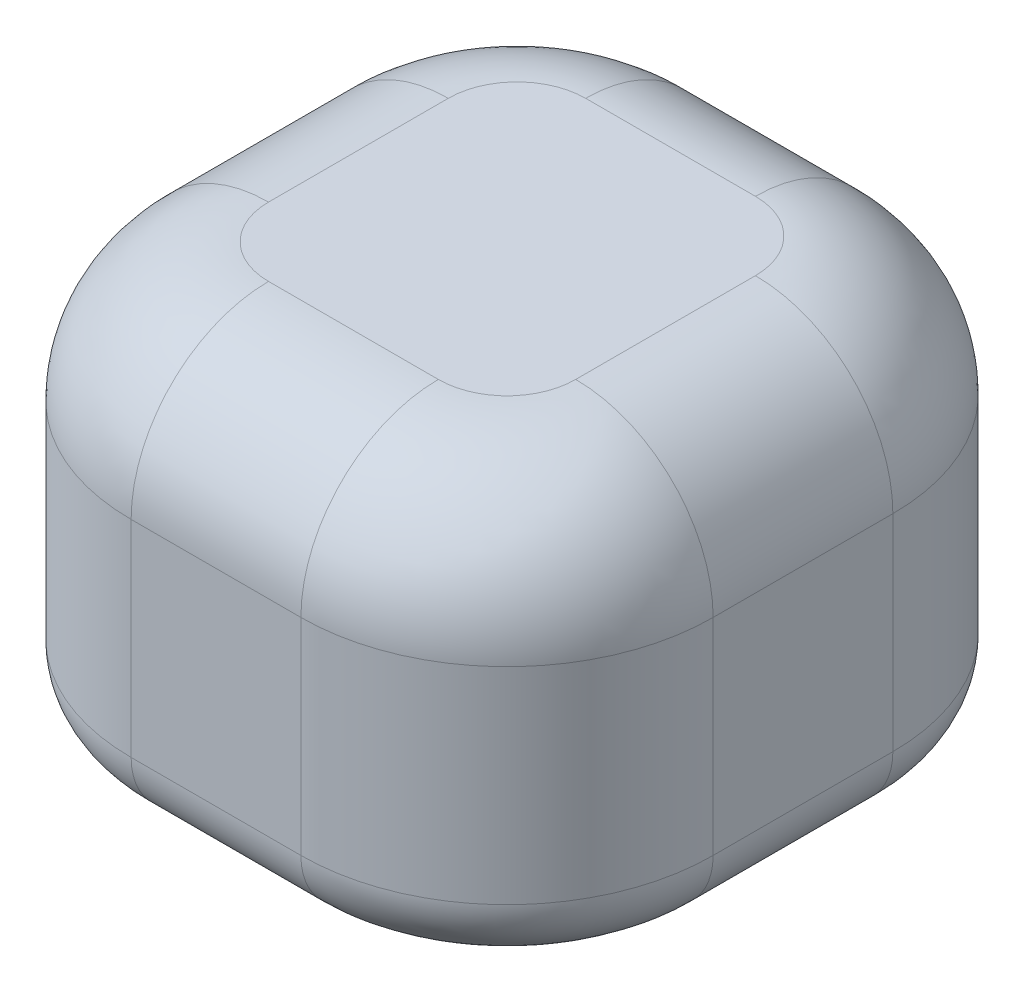
ISO-10303-21;
HEADER;
FILE_DESCRIPTION(('STEP AP214'),'2;1');
FILE_NAME('part.step','',(''),(''),'','','');
FILE_SCHEMA(('AUTOMOTIVE_DESIGN { 1 0 10303 214 1 1 1 1 }'));
ENDSEC;
DATA;
#1=APPLICATION_CONTEXT('core data for automotive mechanical design processes');
#2=APPLICATION_PROTOCOL_DEFINITION('international standard','automotive_design',2000,#1);
#3=PRODUCT_CONTEXT('',#1,'mechanical');
#4=PRODUCT('Part','Part','',(#3));
#5=PRODUCT_RELATED_PRODUCT_CATEGORY('part','',(#4));
#6=PRODUCT_DEFINITION_FORMATION('','',#4);
#7=PRODUCT_DEFINITION_CONTEXT('part definition',#1,'design');
#8=PRODUCT_DEFINITION('design','',#6,#7);
#9=PRODUCT_DEFINITION_SHAPE('','',#8);
#10=(LENGTH_UNIT() NAMED_UNIT(*) SI_UNIT(.MILLI.,.METRE.));
#11=(NAMED_UNIT(*) PLANE_ANGLE_UNIT() SI_UNIT($,.RADIAN.));
#12=(NAMED_UNIT(*) SI_UNIT($,.STERADIAN.) SOLID_ANGLE_UNIT());
#13=UNCERTAINTY_MEASURE_WITH_UNIT(LENGTH_MEASURE(1.E-05),#10,'distance_accuracy_value','');
#14=(GEOMETRIC_REPRESENTATION_CONTEXT(3) GLOBAL_UNCERTAINTY_ASSIGNED_CONTEXT((#13)) GLOBAL_UNIT_ASSIGNED_CONTEXT((#10,
#11,#12)) REPRESENTATION_CONTEXT('',''));
#15=CARTESIAN_POINT('',(0.,0.,0.));
#16=DIRECTION('',(0.,0.,1.));
#17=DIRECTION('',(1.,0.,0.));
#18=AXIS2_PLACEMENT_3D('',#15,#16,#17);
#19=CARTESIAN_POINT('',(42.3541820083916,-30.,43.0798902011261));
#20=DIRECTION('',(1.,0.,0.));
#21=DIRECTION('',(0.,0.,-1.));
#22=AXIS2_PLACEMENT_3D('',#19,#20,#21);
#23=PLANE('',#22);
#24=DIRECTION('',(0.,1.,0.));
#25=VECTOR('',#24,1.);
#26=CARTESIAN_POINT('',(42.3541820083916,-30.,13.0798902011261));
#27=LINE('',#26,#25);
#28=CARTESIAN_POINT('',(42.3541820083916,10.,13.0798902011261));
#29=VERTEX_POINT('',#28);
#30=CARTESIAN_POINT('',(42.3541820083916,-20.,13.0798902011261));
#31=VERTEX_POINT('',#30);
#32=EDGE_CURVE('E292',#29,#31,#27,.F.);
#33=ORIENTED_EDGE('',*,*,#32,.T.);
#34=DIRECTION('',(0.,0.,-1.));
#35=VECTOR('',#34,1.);
#36=CARTESIAN_POINT('',(42.3541820083916,-20.,43.0798902011261));
#37=LINE('',#36,#35);
#38=CARTESIAN_POINT('',(42.3541820083916,-20.,-13.0798902011261));
#39=VERTEX_POINT('',#38);
#40=EDGE_CURVE('E11',#31,#39,#37,.T.);
#41=ORIENTED_EDGE('',*,*,#40,.T.);
#42=DIRECTION('',(0.,1.,0.));
#43=VECTOR('',#42,1.);
#44=CARTESIAN_POINT('',(42.3541820083916,-30.,-13.0798902011261));
#45=LINE('',#44,#43);
#46=CARTESIAN_POINT('',(42.3541820083916,10.,-13.0798902011261));
#47=VERTEX_POINT('',#46);
#48=EDGE_CURVE('E288',#39,#47,#45,.T.);
#49=ORIENTED_EDGE('',*,*,#48,.T.);
#50=DIRECTION('',(0.,0.,-1.));
#51=VECTOR('',#50,1.);
#52=CARTESIAN_POINT('',(42.3541820083916,10.,13.0798902011261));
#53=LINE('',#52,#51);
#54=EDGE_CURVE('E196',#47,#29,#53,.F.);
#55=ORIENTED_EDGE('',*,*,#54,.T.);
#56=EDGE_LOOP('',(#33,#41,#49,#55));
#57=FACE_BOUND('',#56,.T.);
#58=ADVANCED_FACE('F38',(#57),#23,.T.);
#59=CARTESIAN_POINT('',(-42.3541820083916,-30.,43.0798902011261));
#60=DIRECTION('',(0.,0.,1.));
#61=DIRECTION('',(1.,0.,0.));
#62=AXIS2_PLACEMENT_3D('',#59,#60,#61);
#63=PLANE('',#62);
#64=DIRECTION('',(0.,1.,0.));
#65=VECTOR('',#64,1.);
#66=CARTESIAN_POINT('',(-12.3541820083916,-30.,43.0798902011261));
#67=LINE('',#66,#65);
#68=CARTESIAN_POINT('',(-12.3541820083916,10.,43.0798902011261));
#69=VERTEX_POINT('',#68);
#70=CARTESIAN_POINT('',(-12.3541820083916,-20.,43.0798902011261));
#71=VERTEX_POINT('',#70);
#72=EDGE_CURVE('E221',#69,#71,#67,.F.);
#73=ORIENTED_EDGE('',*,*,#72,.T.);
#74=DIRECTION('',(1.,0.,0.));
#75=VECTOR('',#74,1.);
#76=CARTESIAN_POINT('',(-42.3541820083916,-20.,43.0798902011261));
#77=LINE('',#76,#75);
#78=CARTESIAN_POINT('',(12.3541820083916,-20.,43.0798902011261));
#79=VERTEX_POINT('',#78);
#80=EDGE_CURVE('E62',#71,#79,#77,.T.);
#81=ORIENTED_EDGE('',*,*,#80,.T.);
#82=DIRECTION('',(0.,1.,0.));
#83=VECTOR('',#82,1.);
#84=CARTESIAN_POINT('',(12.3541820083916,-30.,43.0798902011261));
#85=LINE('',#84,#83);
#86=CARTESIAN_POINT('',(12.3541820083916,10.,43.0798902011261));
#87=VERTEX_POINT('',#86);
#88=EDGE_CURVE('E286',#79,#87,#85,.T.);
#89=ORIENTED_EDGE('',*,*,#88,.T.);
#90=DIRECTION('',(1.,0.,0.));
#91=VECTOR('',#90,1.);
#92=CARTESIAN_POINT('',(-12.3541820083916,10.,43.0798902011261));
#93=LINE('',#92,#91);
#94=EDGE_CURVE('E201',#87,#69,#93,.F.);
#95=ORIENTED_EDGE('',*,*,#94,.T.);
#96=EDGE_LOOP('',(#73,#81,#89,#95));
#97=FACE_BOUND('',#96,.T.);
#98=ADVANCED_FACE('F285',(#97),#63,.T.);
#99=CARTESIAN_POINT('',(-42.3541820083916,-30.,43.0798902011261));
#100=DIRECTION('',(-1.,0.,0.));
#101=DIRECTION('',(0.,0.,1.));
#102=AXIS2_PLACEMENT_3D('',#99,#100,#101);
#103=PLANE('',#102);
#104=DIRECTION('',(0.,1.,0.));
#105=VECTOR('',#104,1.);
#106=CARTESIAN_POINT('',(-42.3541820083916,-30.,-13.0798902011261));
#107=LINE('',#106,#105);
#108=CARTESIAN_POINT('',(-42.3541820083916,10.,-13.0798902011261));
#109=VERTEX_POINT('',#108);
#110=CARTESIAN_POINT('',(-42.3541820083916,-20.,-13.0798902011261));
#111=VERTEX_POINT('',#110);
#112=EDGE_CURVE('E299',#109,#111,#107,.F.);
#113=ORIENTED_EDGE('',*,*,#112,.T.);
#114=DIRECTION('',(0.,0.,1.));
#115=VECTOR('',#114,1.);
#116=CARTESIAN_POINT('',(-42.3541820083916,-20.,43.0798902011261));
#117=LINE('',#116,#115);
#118=CARTESIAN_POINT('',(-42.3541820083916,-20.,13.0798902011261));
#119=VERTEX_POINT('',#118);
#120=EDGE_CURVE('E245',#111,#119,#117,.T.);
#121=ORIENTED_EDGE('',*,*,#120,.T.);
#122=DIRECTION('',(0.,1.,0.));
#123=VECTOR('',#122,1.);
#124=CARTESIAN_POINT('',(-42.3541820083916,-30.,13.0798902011261));
#125=LINE('',#124,#123);
#126=CARTESIAN_POINT('',(-42.3541820083916,10.,13.0798902011261));
#127=VERTEX_POINT('',#126);
#128=EDGE_CURVE('E174',#119,#127,#125,.T.);
#129=ORIENTED_EDGE('',*,*,#128,.T.);
#130=DIRECTION('',(0.,0.,1.));
#131=VECTOR('',#130,1.);
#132=CARTESIAN_POINT('',(-42.3541820083916,10.,-13.0798902011261));
#133=LINE('',#132,#131);
#134=EDGE_CURVE('E181',#127,#109,#133,.F.);
#135=ORIENTED_EDGE('',*,*,#134,.T.);
#136=EDGE_LOOP('',(#113,#121,#129,#135));
#137=FACE_BOUND('',#136,.T.);
#138=ADVANCED_FACE('F321',(#137),#103,.T.);
#139=CARTESIAN_POINT('',(-42.3541820083916,-30.,-43.0798902011261));
#140=DIRECTION('',(0.,0.,-1.));
#141=DIRECTION('',(-1.,0.,0.));
#142=AXIS2_PLACEMENT_3D('',#139,#140,#141);
#143=PLANE('',#142);
#144=DIRECTION('',(0.,1.,0.));
#145=VECTOR('',#144,1.);
#146=CARTESIAN_POINT('',(12.3541820083916,-30.,-43.0798902011261));
#147=LINE('',#146,#145);
#148=CARTESIAN_POINT('',(12.3541820083916,10.,-43.0798902011261));
#149=VERTEX_POINT('',#148);
#150=CARTESIAN_POINT('',(12.3541820083916,-20.,-43.0798902011261));
#151=VERTEX_POINT('',#150);
#152=EDGE_CURVE('E296',#149,#151,#147,.F.);
#153=ORIENTED_EDGE('',*,*,#152,.T.);
#154=DIRECTION('',(-1.,0.,0.));
#155=VECTOR('',#154,1.);
#156=CARTESIAN_POINT('',(-42.3541820083916,-20.,-43.0798902011261));
#157=LINE('',#156,#155);
#158=CARTESIAN_POINT('',(-12.3541820083916,-20.,-43.0798902011261));
#159=VERTEX_POINT('',#158);
#160=EDGE_CURVE('E241',#151,#159,#157,.T.);
#161=ORIENTED_EDGE('',*,*,#160,.T.);
#162=DIRECTION('',(0.,1.,0.));
#163=VECTOR('',#162,1.);
#164=CARTESIAN_POINT('',(-12.3541820083916,-30.,-43.0798902011261));
#165=LINE('',#164,#163);
#166=CARTESIAN_POINT('',(-12.3541820083916,10.,-43.0798902011261));
#167=VERTEX_POINT('',#166);
#168=EDGE_CURVE('E294',#159,#167,#165,.T.);
#169=ORIENTED_EDGE('',*,*,#168,.T.);
#170=DIRECTION('',(-1.,0.,0.));
#171=VECTOR('',#170,1.);
#172=CARTESIAN_POINT('',(12.3541820083916,10.,-43.0798902011261));
#173=LINE('',#172,#171);
#174=EDGE_CURVE('E191',#167,#149,#173,.F.);
#175=ORIENTED_EDGE('',*,*,#174,.T.);
#176=EDGE_LOOP('',(#153,#161,#169,#175));
#177=FACE_BOUND('',#176,.T.);
#178=ADVANCED_FACE('F375',(#177),#143,.T.);
#179=CARTESIAN_POINT('',(0.,-30.,0.));
#180=DIRECTION('',(0.,-1.,0.));
#181=DIRECTION('',(0.,0.,-1.));
#182=AXIS2_PLACEMENT_3D('',#179,#180,#181);
#183=PLANE('',#182);
#184=DIRECTION('',(-1.,0.,0.));
#185=VECTOR('',#184,1.);
#186=CARTESIAN_POINT('',(0.,-30.,-33.0798902011261));
#187=LINE('',#186,#185);
#188=CARTESIAN_POINT('',(-12.3541820083916,-30.,-33.0798902011261));
#189=VERTEX_POINT('',#188);
#190=CARTESIAN_POINT('',(12.3541820083916,-30.,-33.0798902011261));
#191=VERTEX_POINT('',#190);
#192=EDGE_CURVE('E233',#189,#191,#187,.F.);
#193=ORIENTED_EDGE('',*,*,#192,.T.);
#194=CARTESIAN_POINT('',(12.3541820083916,-30.,-13.0798902011261));
#195=DIRECTION('',(0.,-1.,0.));
#196=DIRECTION('',(0.,0.,-1.));
#197=AXIS2_PLACEMENT_3D('',#194,#195,#196);
#198=CIRCLE('',#197,20.);
#199=CARTESIAN_POINT('',(32.3541820083916,-30.,-13.0798902011261));
#200=VERTEX_POINT('',#199);
#201=EDGE_CURVE('E235',#191,#200,#198,.T.);
#202=ORIENTED_EDGE('',*,*,#201,.T.);
#203=DIRECTION('',(0.,0.,-1.));
#204=VECTOR('',#203,1.);
#205=CARTESIAN_POINT('',(32.3541820083916,-30.,0.));
#206=LINE('',#205,#204);
#207=CARTESIAN_POINT('',(32.3541820083916,-30.,13.0798902011261));
#208=VERTEX_POINT('',#207);
#209=EDGE_CURVE('E202',#200,#208,#206,.F.);
#210=ORIENTED_EDGE('',*,*,#209,.T.);
#211=CARTESIAN_POINT('',(12.3541820083916,-30.,13.0798902011261));
#212=DIRECTION('',(0.,-1.,0.));
#213=DIRECTION('',(0.,0.,-1.));
#214=AXIS2_PLACEMENT_3D('',#211,#212,#213);
#215=CIRCLE('',#214,20.);
#216=CARTESIAN_POINT('',(12.3541820083916,-30.,33.0798902011261));
#217=VERTEX_POINT('',#216);
#218=EDGE_CURVE('E223',#208,#217,#215,.T.);
#219=ORIENTED_EDGE('',*,*,#218,.T.);
#220=DIRECTION('',(1.,0.,0.));
#221=VECTOR('',#220,1.);
#222=CARTESIAN_POINT('',(0.,-30.,33.0798902011261));
#223=LINE('',#222,#221);
#224=CARTESIAN_POINT('',(-12.3541820083916,-30.,33.0798902011261));
#225=VERTEX_POINT('',#224);
#226=EDGE_CURVE('E225',#217,#225,#223,.F.);
#227=ORIENTED_EDGE('',*,*,#226,.T.);
#228=CARTESIAN_POINT('',(-12.3541820083916,-30.,13.0798902011261));
#229=DIRECTION('',(0.,-1.,0.));
#230=DIRECTION('',(0.,0.,-1.));
#231=AXIS2_PLACEMENT_3D('',#228,#229,#230);
#232=CIRCLE('',#231,20.);
#233=CARTESIAN_POINT('',(-32.3541820083916,-30.,13.0798902011261));
#234=VERTEX_POINT('',#233);
#235=EDGE_CURVE('E227',#225,#234,#232,.T.);
#236=ORIENTED_EDGE('',*,*,#235,.T.);
#237=DIRECTION('',(0.,0.,1.));
#238=VECTOR('',#237,1.);
#239=CARTESIAN_POINT('',(-32.3541820083916,-30.,0.));
#240=LINE('',#239,#238);
#241=CARTESIAN_POINT('',(-32.3541820083916,-30.,-13.0798902011261));
#242=VERTEX_POINT('',#241);
#243=EDGE_CURVE('E229',#234,#242,#240,.F.);
#244=ORIENTED_EDGE('',*,*,#243,.T.);
#245=CARTESIAN_POINT('',(-12.3541820083916,-30.,-13.0798902011261));
#246=DIRECTION('',(0.,-1.,0.));
#247=DIRECTION('',(0.,0.,-1.));
#248=AXIS2_PLACEMENT_3D('',#245,#246,#247);
#249=CIRCLE('',#248,20.);
#250=EDGE_CURVE('E231',#242,#189,#249,.T.);
#251=ORIENTED_EDGE('',*,*,#250,.T.);
#252=EDGE_LOOP('',(#193,#202,#210,#219,#227,#236,#244,#251));
#253=FACE_BOUND('',#252,.T.);
#254=ADVANCED_FACE('F338',(#253),#183,.T.);
#255=CARTESIAN_POINT('',(0.,30.,0.));
#256=DIRECTION('',(0.,-1.,0.));
#257=DIRECTION('',(0.,0.,-1.));
#258=AXIS2_PLACEMENT_3D('',#255,#256,#257);
#259=PLANE('',#258);
#260=DIRECTION('',(0.,0.,1.));
#261=VECTOR('',#260,1.);
#262=CARTESIAN_POINT('',(-22.3541820083916,30.,13.0798902011261));
#263=LINE('',#262,#261);
#264=CARTESIAN_POINT('',(-22.3541820083916,30.,-13.0798902011261));
#265=VERTEX_POINT('',#264);
#266=CARTESIAN_POINT('',(-22.3541820083916,30.,13.0798902011261));
#267=VERTEX_POINT('',#266);
#268=EDGE_CURVE('E178',#265,#267,#263,.T.);
#269=ORIENTED_EDGE('',*,*,#268,.T.);
#270=CARTESIAN_POINT('',(-12.3541820083916,30.,13.0798902011261));
#271=DIRECTION('',(0.,-1.,0.));
#272=DIRECTION('',(0.,0.,-1.));
#273=AXIS2_PLACEMENT_3D('',#270,#271,#272);
#274=CIRCLE('',#273,10.);
#275=CARTESIAN_POINT('',(-12.3541820083916,30.,23.0798902011261));
#276=VERTEX_POINT('',#275);
#277=EDGE_CURVE('E159',#267,#276,#274,.F.);
#278=ORIENTED_EDGE('',*,*,#277,.T.);
#279=DIRECTION('',(1.,0.,0.));
#280=VECTOR('',#279,1.);
#281=CARTESIAN_POINT('',(12.3541820083916,30.,23.0798902011261));
#282=LINE('',#281,#280);
#283=CARTESIAN_POINT('',(12.3541820083916,30.,23.0798902011261));
#284=VERTEX_POINT('',#283);
#285=EDGE_CURVE('E167',#276,#284,#282,.T.);
#286=ORIENTED_EDGE('',*,*,#285,.T.);
#287=CARTESIAN_POINT('',(12.3541820083916,30.,13.0798902011261));
#288=DIRECTION('',(0.,-1.,0.));
#289=DIRECTION('',(0.,0.,-1.));
#290=AXIS2_PLACEMENT_3D('',#287,#288,#289);
#291=CIRCLE('',#290,10.);
#292=CARTESIAN_POINT('',(22.3541820083916,30.,13.0798902011261));
#293=VERTEX_POINT('',#292);
#294=EDGE_CURVE('E173',#284,#293,#291,.F.);
#295=ORIENTED_EDGE('',*,*,#294,.T.);
#296=DIRECTION('',(0.,0.,-1.));
#297=VECTOR('',#296,1.);
#298=CARTESIAN_POINT('',(22.3541820083916,30.,-13.0798902011261));
#299=LINE('',#298,#297);
#300=CARTESIAN_POINT('',(22.3541820083916,30.,-13.0798902011261));
#301=VERTEX_POINT('',#300);
#302=EDGE_CURVE('E304',#293,#301,#299,.T.);
#303=ORIENTED_EDGE('',*,*,#302,.T.);
#304=CARTESIAN_POINT('',(12.3541820083916,30.,-13.0798902011261));
#305=DIRECTION('',(0.,-1.,0.));
#306=DIRECTION('',(0.,0.,-1.));
#307=AXIS2_PLACEMENT_3D('',#304,#305,#306);
#308=CIRCLE('',#307,10.);
#309=CARTESIAN_POINT('',(12.3541820083916,30.,-23.0798902011261));
#310=VERTEX_POINT('',#309);
#311=EDGE_CURVE('E306',#301,#310,#308,.F.);
#312=ORIENTED_EDGE('',*,*,#311,.T.);
#313=DIRECTION('',(-1.,0.,0.));
#314=VECTOR('',#313,1.);
#315=CARTESIAN_POINT('',(-12.3541820083916,30.,-23.0798902011261));
#316=LINE('',#315,#314);
#317=CARTESIAN_POINT('',(-12.3541820083916,30.,-23.0798902011261));
#318=VERTEX_POINT('',#317);
#319=EDGE_CURVE('E308',#310,#318,#316,.T.);
#320=ORIENTED_EDGE('',*,*,#319,.T.);
#321=CARTESIAN_POINT('',(-12.3541820083916,30.,-13.0798902011261));
#322=DIRECTION('',(0.,-1.,0.));
#323=DIRECTION('',(0.,0.,-1.));
#324=AXIS2_PLACEMENT_3D('',#321,#322,#323);
#325=CIRCLE('',#324,10.);
#326=EDGE_CURVE('E183',#318,#265,#325,.F.);
#327=ORIENTED_EDGE('',*,*,#326,.T.);
#328=EDGE_LOOP('',(#269,#278,#286,#295,#303,#312,#320,#327));
#329=FACE_BOUND('',#328,.T.);
#330=ADVANCED_FACE('F176',(#329),#259,.F.);
#331=CARTESIAN_POINT('',(12.3541820083916,-30.,13.0798902011261));
#332=DIRECTION('',(0.,1.,0.));
#333=DIRECTION('',(0.,0.,1.));
#334=AXIS2_PLACEMENT_3D('',#331,#332,#333);
#335=CYLINDRICAL_SURFACE('',#334,30.);
#336=ORIENTED_EDGE('',*,*,#88,.F.);
#337=CARTESIAN_POINT('',(12.3541820083916,-20.,13.0798902011261));
#338=DIRECTION('',(0.,-1.,0.));
#339=DIRECTION('',(0.,0.,-1.));
#340=AXIS2_PLACEMENT_3D('',#337,#338,#339);
#341=CIRCLE('',#340,30.);
#342=EDGE_CURVE('E47',#79,#31,#341,.F.);
#343=ORIENTED_EDGE('',*,*,#342,.T.);
#344=ORIENTED_EDGE('',*,*,#32,.F.);
#345=CARTESIAN_POINT('',(12.3541820083916,10.,13.0798902011261));
#346=DIRECTION('',(0.,-1.,0.));
#347=DIRECTION('',(0.,0.,-1.));
#348=AXIS2_PLACEMENT_3D('',#345,#346,#347);
#349=CIRCLE('',#348,30.);
#350=EDGE_CURVE('E198',#29,#87,#349,.T.);
#351=ORIENTED_EDGE('',*,*,#350,.T.);
#352=EDGE_LOOP('',(#336,#343,#344,#351));
#353=FACE_BOUND('',#352,.T.);
#354=ADVANCED_FACE('F377',(#353),#335,.T.);
#355=CARTESIAN_POINT('',(12.3541820083916,-30.,-13.0798902011261));
#356=DIRECTION('',(0.,1.,0.));
#357=DIRECTION('',(0.,0.,1.));
#358=AXIS2_PLACEMENT_3D('',#355,#356,#357);
#359=CYLINDRICAL_SURFACE('',#358,30.);
#360=ORIENTED_EDGE('',*,*,#48,.F.);
#361=CARTESIAN_POINT('',(12.3541820083916,-20.,-13.0798902011261));
#362=DIRECTION('',(0.,-1.,0.));
#363=DIRECTION('',(0.,0.,-1.));
#364=AXIS2_PLACEMENT_3D('',#361,#362,#363);
#365=CIRCLE('',#364,30.);
#366=EDGE_CURVE('E238',#39,#151,#365,.F.);
#367=ORIENTED_EDGE('',*,*,#366,.T.);
#368=ORIENTED_EDGE('',*,*,#152,.F.);
#369=CARTESIAN_POINT('',(12.3541820083916,10.,-13.0798902011261));
#370=DIRECTION('',(0.,-1.,0.));
#371=DIRECTION('',(0.,0.,-1.));
#372=AXIS2_PLACEMENT_3D('',#369,#370,#371);
#373=CIRCLE('',#372,30.);
#374=EDGE_CURVE('E193',#149,#47,#373,.T.);
#375=ORIENTED_EDGE('',*,*,#374,.T.);
#376=EDGE_LOOP('',(#360,#367,#368,#375));
#377=FACE_BOUND('',#376,.T.);
#378=ADVANCED_FACE('F354',(#377),#359,.T.);
#379=CARTESIAN_POINT('',(-12.3541820083916,-30.,13.0798902011261));
#380=DIRECTION('',(0.,1.,0.));
#381=DIRECTION('',(0.,0.,1.));
#382=AXIS2_PLACEMENT_3D('',#379,#380,#381);
#383=CYLINDRICAL_SURFACE('',#382,30.);
#384=ORIENTED_EDGE('',*,*,#128,.F.);
#385=CARTESIAN_POINT('',(-12.3541820083916,-20.,13.0798902011261));
#386=DIRECTION('',(0.,-1.,0.));
#387=DIRECTION('',(0.,0.,-1.));
#388=AXIS2_PLACEMENT_3D('',#385,#386,#387);
#389=CIRCLE('',#388,30.);
#390=EDGE_CURVE('E247',#119,#71,#389,.F.);
#391=ORIENTED_EDGE('',*,*,#390,.T.);
#392=ORIENTED_EDGE('',*,*,#72,.F.);
#393=CARTESIAN_POINT('',(-12.3541820083916,10.,13.0798902011261));
#394=DIRECTION('',(0.,-1.,0.));
#395=DIRECTION('',(0.,0.,-1.));
#396=AXIS2_PLACEMENT_3D('',#393,#394,#395);
#397=CIRCLE('',#396,30.);
#398=EDGE_CURVE('E161',#69,#127,#397,.T.);
#399=ORIENTED_EDGE('',*,*,#398,.T.);
#400=EDGE_LOOP('',(#384,#391,#392,#399));
#401=FACE_BOUND('',#400,.T.);
#402=ADVANCED_FACE('F284',(#401),#383,.T.);
#403=CARTESIAN_POINT('',(-12.3541820083916,-30.,-13.0798902011261));
#404=DIRECTION('',(0.,1.,0.));
#405=DIRECTION('',(0.,0.,1.));
#406=AXIS2_PLACEMENT_3D('',#403,#404,#405);
#407=CYLINDRICAL_SURFACE('',#406,30.);
#408=ORIENTED_EDGE('',*,*,#168,.F.);
#409=CARTESIAN_POINT('',(-12.3541820083916,-20.,-13.0798902011261));
#410=DIRECTION('',(0.,-1.,0.));
#411=DIRECTION('',(0.,0.,-1.));
#412=AXIS2_PLACEMENT_3D('',#409,#410,#411);
#413=CIRCLE('',#412,30.);
#414=EDGE_CURVE('E243',#159,#111,#413,.F.);
#415=ORIENTED_EDGE('',*,*,#414,.T.);
#416=ORIENTED_EDGE('',*,*,#112,.F.);
#417=CARTESIAN_POINT('',(-12.3541820083916,10.,-13.0798902011261));
#418=DIRECTION('',(0.,-1.,0.));
#419=DIRECTION('',(0.,0.,-1.));
#420=AXIS2_PLACEMENT_3D('',#417,#418,#419);
#421=CIRCLE('',#420,30.);
#422=EDGE_CURVE('E188',#109,#167,#421,.T.);
#423=ORIENTED_EDGE('',*,*,#422,.T.);
#424=EDGE_LOOP('',(#408,#415,#416,#423));
#425=FACE_BOUND('',#424,.T.);
#426=ADVANCED_FACE('F324',(#425),#407,.T.);
#427=CARTESIAN_POINT('',(12.3541820083916,10.,-13.0798902011261));
#428=DIRECTION('',(0.,-1.,0.));
#429=DIRECTION('',(0.,0.,-1.));
#430=AXIS2_PLACEMENT_3D('',#427,#428,#429);
#431=DEGENERATE_TOROIDAL_SURFACE('',#430,10.,20.,.T.);
#432=CARTESIAN_POINT('',(22.3541820083916,10.,-13.0798902011261));
#433=DIRECTION('',(0.,0.,1.));
#434=DIRECTION('',(1.,0.,0.));
#435=AXIS2_PLACEMENT_3D('',#432,#433,#434);
#436=CIRCLE('',#435,20.);
#437=EDGE_CURVE('E215',#47,#301,#436,.T.);
#438=ORIENTED_EDGE('',*,*,#437,.F.);
#439=ORIENTED_EDGE('',*,*,#374,.F.);
#440=CARTESIAN_POINT('',(12.3541820083916,10.,-23.0798902011261));
#441=DIRECTION('',(-1.,0.,0.));
#442=DIRECTION('',(0.,0.,1.));
#443=AXIS2_PLACEMENT_3D('',#440,#441,#442);
#444=CIRCLE('',#443,20.);
#445=EDGE_CURVE('E218',#310,#149,#444,.T.);
#446=ORIENTED_EDGE('',*,*,#445,.F.);
#447=ORIENTED_EDGE('',*,*,#311,.F.);
#448=EDGE_LOOP('',(#438,#439,#446,#447));
#449=FACE_BOUND('',#448,.T.);
#450=ADVANCED_FACE('F386',(#449),#431,.T.);
#451=CARTESIAN_POINT('',(0.,10.,-23.0798902011261));
#452=DIRECTION('',(1.,0.,0.));
#453=DIRECTION('',(0.,0.,-1.));
#454=AXIS2_PLACEMENT_3D('',#451,#452,#453);
#455=CYLINDRICAL_SURFACE('',#454,20.);
#456=ORIENTED_EDGE('',*,*,#445,.T.);
#457=ORIENTED_EDGE('',*,*,#174,.F.);
#458=CARTESIAN_POINT('',(-12.3541820083916,10.,-23.0798902011261));
#459=DIRECTION('',(-1.,0.,0.));
#460=DIRECTION('',(0.,0.,1.));
#461=AXIS2_PLACEMENT_3D('',#458,#459,#460);
#462=CIRCLE('',#461,20.);
#463=EDGE_CURVE('E212',#318,#167,#462,.T.);
#464=ORIENTED_EDGE('',*,*,#463,.F.);
#465=ORIENTED_EDGE('',*,*,#319,.F.);
#466=EDGE_LOOP('',(#456,#457,#464,#465));
#467=FACE_BOUND('',#466,.T.);
#468=ADVANCED_FACE('F402',(#467),#455,.T.);
#469=CARTESIAN_POINT('',(22.3541820083916,10.,0.));
#470=DIRECTION('',(0.,0.,1.));
#471=DIRECTION('',(1.,0.,0.));
#472=AXIS2_PLACEMENT_3D('',#469,#470,#471);
#473=CYLINDRICAL_SURFACE('',#472,20.);
#474=ORIENTED_EDGE('',*,*,#437,.T.);
#475=ORIENTED_EDGE('',*,*,#302,.F.);
#476=CARTESIAN_POINT('',(22.3541820083916,10.,13.0798902011261));
#477=DIRECTION('',(0.,0.,1.));
#478=DIRECTION('',(1.,0.,0.));
#479=AXIS2_PLACEMENT_3D('',#476,#477,#478);
#480=CIRCLE('',#479,20.);
#481=EDGE_CURVE('E209',#29,#293,#480,.T.);
#482=ORIENTED_EDGE('',*,*,#481,.F.);
#483=ORIENTED_EDGE('',*,*,#54,.F.);
#484=EDGE_LOOP('',(#474,#475,#482,#483));
#485=FACE_BOUND('',#484,.T.);
#486=ADVANCED_FACE('F399',(#485),#473,.T.);
#487=CARTESIAN_POINT('',(-12.3541820083916,10.,-13.0798902011261));
#488=DIRECTION('',(0.,-1.,0.));
#489=DIRECTION('',(0.,0.,-1.));
#490=AXIS2_PLACEMENT_3D('',#487,#488,#489);
#491=DEGENERATE_TOROIDAL_SURFACE('',#490,10.,20.,.T.);
#492=ORIENTED_EDGE('',*,*,#463,.T.);
#493=ORIENTED_EDGE('',*,*,#422,.F.);
#494=CARTESIAN_POINT('',(-22.3541820083916,10.,-13.0798902011261));
#495=DIRECTION('',(0.,0.,1.));
#496=DIRECTION('',(1.,0.,0.));
#497=AXIS2_PLACEMENT_3D('',#494,#495,#496);
#498=CIRCLE('',#497,20.);
#499=EDGE_CURVE('E206',#265,#109,#498,.T.);
#500=ORIENTED_EDGE('',*,*,#499,.F.);
#501=ORIENTED_EDGE('',*,*,#326,.F.);
#502=EDGE_LOOP('',(#492,#493,#500,#501));
#503=FACE_BOUND('',#502,.T.);
#504=ADVANCED_FACE('F315',(#503),#491,.T.);
#505=CARTESIAN_POINT('',(12.3541820083916,10.,13.0798902011261));
#506=DIRECTION('',(0.,-1.,0.));
#507=DIRECTION('',(0.,0.,-1.));
#508=AXIS2_PLACEMENT_3D('',#505,#506,#507);
#509=DEGENERATE_TOROIDAL_SURFACE('',#508,10.,20.,.T.);
#510=ORIENTED_EDGE('',*,*,#481,.T.);
#511=ORIENTED_EDGE('',*,*,#294,.F.);
#512=CARTESIAN_POINT('',(12.3541820083916,10.,23.0798902011261));
#513=DIRECTION('',(-1.,0.,0.));
#514=DIRECTION('',(0.,0.,1.));
#515=AXIS2_PLACEMENT_3D('',#512,#513,#514);
#516=CIRCLE('',#515,20.);
#517=EDGE_CURVE('E170',#87,#284,#516,.T.);
#518=ORIENTED_EDGE('',*,*,#517,.F.);
#519=ORIENTED_EDGE('',*,*,#350,.F.);
#520=EDGE_LOOP('',(#510,#511,#518,#519));
#521=FACE_BOUND('',#520,.T.);
#522=ADVANCED_FACE('F393',(#521),#509,.T.);
#523=CARTESIAN_POINT('',(-22.3541820083916,10.,0.));
#524=DIRECTION('',(0.,0.,-1.));
#525=DIRECTION('',(-1.,0.,0.));
#526=AXIS2_PLACEMENT_3D('',#523,#524,#525);
#527=CYLINDRICAL_SURFACE('',#526,20.);
#528=ORIENTED_EDGE('',*,*,#499,.T.);
#529=ORIENTED_EDGE('',*,*,#134,.F.);
#530=CARTESIAN_POINT('',(-22.3541820083916,10.,13.0798902011261));
#531=DIRECTION('',(0.,0.,1.));
#532=DIRECTION('',(1.,0.,0.));
#533=AXIS2_PLACEMENT_3D('',#530,#531,#532);
#534=CIRCLE('',#533,20.);
#535=EDGE_CURVE('E164',#267,#127,#534,.T.);
#536=ORIENTED_EDGE('',*,*,#535,.F.);
#537=ORIENTED_EDGE('',*,*,#268,.F.);
#538=EDGE_LOOP('',(#528,#529,#536,#537));
#539=FACE_BOUND('',#538,.T.);
#540=ADVANCED_FACE('F318',(#539),#527,.T.);
#541=CARTESIAN_POINT('',(0.,10.,23.0798902011261));
#542=DIRECTION('',(-1.,0.,0.));
#543=DIRECTION('',(0.,0.,1.));
#544=AXIS2_PLACEMENT_3D('',#541,#542,#543);
#545=CYLINDRICAL_SURFACE('',#544,20.);
#546=ORIENTED_EDGE('',*,*,#517,.T.);
#547=ORIENTED_EDGE('',*,*,#285,.F.);
#548=CARTESIAN_POINT('',(-12.3541820083916,10.,23.0798902011261));
#549=DIRECTION('',(-1.,0.,0.));
#550=DIRECTION('',(0.,0.,1.));
#551=AXIS2_PLACEMENT_3D('',#548,#549,#550);
#552=CIRCLE('',#551,20.);
#553=EDGE_CURVE('E154',#69,#276,#552,.T.);
#554=ORIENTED_EDGE('',*,*,#553,.F.);
#555=ORIENTED_EDGE('',*,*,#94,.F.);
#556=EDGE_LOOP('',(#546,#547,#554,#555));
#557=FACE_BOUND('',#556,.T.);
#558=ADVANCED_FACE('F168',(#557),#545,.T.);
#559=CARTESIAN_POINT('',(-12.3541820083916,10.,13.0798902011261));
#560=DIRECTION('',(0.,-1.,0.));
#561=DIRECTION('',(0.,0.,-1.));
#562=AXIS2_PLACEMENT_3D('',#559,#560,#561);
#563=DEGENERATE_TOROIDAL_SURFACE('',#562,10.,20.,.T.);
#564=ORIENTED_EDGE('',*,*,#535,.T.);
#565=ORIENTED_EDGE('',*,*,#398,.F.);
#566=ORIENTED_EDGE('',*,*,#553,.T.);
#567=ORIENTED_EDGE('',*,*,#277,.F.);
#568=EDGE_LOOP('',(#564,#565,#566,#567));
#569=FACE_BOUND('',#568,.T.);
#570=ADVANCED_FACE('F157',(#569),#563,.T.);
#571=CARTESIAN_POINT('',(-12.3541820083916,-20.,13.0798902011261));
#572=DIRECTION('',(0.,-1.,0.));
#573=DIRECTION('',(0.,0.,-1.));
#574=AXIS2_PLACEMENT_3D('',#571,#572,#573);
#575=TOROIDAL_SURFACE('',#574,20.,10.);
#576=CARTESIAN_POINT('',(-12.3541820083916,-20.,33.0798902011261));
#577=DIRECTION('',(1.,0.,0.));
#578=DIRECTION('',(0.,0.,-1.));
#579=AXIS2_PLACEMENT_3D('',#576,#577,#578);
#580=CIRCLE('',#579,10.);
#581=EDGE_CURVE('E266',#71,#225,#580,.T.);
#582=ORIENTED_EDGE('',*,*,#581,.F.);
#583=ORIENTED_EDGE('',*,*,#390,.F.);
#584=CARTESIAN_POINT('',(-32.3541820083916,-20.,13.0798902011261));
#585=DIRECTION('',(0.,0.,-1.));
#586=DIRECTION('',(-1.,0.,0.));
#587=AXIS2_PLACEMENT_3D('',#584,#585,#586);
#588=CIRCLE('',#587,10.);
#589=EDGE_CURVE('E42',#234,#119,#588,.T.);
#590=ORIENTED_EDGE('',*,*,#589,.F.);
#591=ORIENTED_EDGE('',*,*,#235,.F.);
#592=EDGE_LOOP('',(#582,#583,#590,#591));
#593=FACE_BOUND('',#592,.T.);
#594=ADVANCED_FACE('F40',(#593),#575,.T.);
#595=CARTESIAN_POINT('',(-32.3541820083916,-20.,43.0798902011261));
#596=DIRECTION('',(0.,0.,1.));
#597=DIRECTION('',(1.,0.,0.));
#598=AXIS2_PLACEMENT_3D('',#595,#596,#597);
#599=CYLINDRICAL_SURFACE('',#598,10.);
#600=ORIENTED_EDGE('',*,*,#589,.T.);
#601=ORIENTED_EDGE('',*,*,#120,.F.);
#602=CARTESIAN_POINT('',(-32.3541820083916,-20.,-13.0798902011261));
#603=DIRECTION('',(0.,0.,-1.));
#604=DIRECTION('',(-1.,0.,0.));
#605=AXIS2_PLACEMENT_3D('',#602,#603,#604);
#606=CIRCLE('',#605,10.);
#607=EDGE_CURVE('E264',#242,#111,#606,.T.);
#608=ORIENTED_EDGE('',*,*,#607,.F.);
#609=ORIENTED_EDGE('',*,*,#243,.F.);
#610=EDGE_LOOP('',(#600,#601,#608,#609));
#611=FACE_BOUND('',#610,.T.);
#612=ADVANCED_FACE('F276',(#611),#599,.T.);
#613=CARTESIAN_POINT('',(-42.3541820083916,-20.,33.0798902011261));
#614=DIRECTION('',(1.,0.,0.));
#615=DIRECTION('',(0.,0.,-1.));
#616=AXIS2_PLACEMENT_3D('',#613,#614,#615);
#617=CYLINDRICAL_SURFACE('',#616,10.);
#618=ORIENTED_EDGE('',*,*,#581,.T.);
#619=ORIENTED_EDGE('',*,*,#226,.F.);
#620=CARTESIAN_POINT('',(12.3541820083916,-20.,33.0798902011261));
#621=DIRECTION('',(1.,0.,0.));
#622=DIRECTION('',(0.,0.,-1.));
#623=AXIS2_PLACEMENT_3D('',#620,#621,#622);
#624=CIRCLE('',#623,10.);
#625=EDGE_CURVE('E261',#79,#217,#624,.T.);
#626=ORIENTED_EDGE('',*,*,#625,.F.);
#627=ORIENTED_EDGE('',*,*,#80,.F.);
#628=EDGE_LOOP('',(#618,#619,#626,#627));
#629=FACE_BOUND('',#628,.T.);
#630=ADVANCED_FACE('F341',(#629),#617,.T.);
#631=CARTESIAN_POINT('',(-12.3541820083916,-20.,-13.0798902011261));
#632=DIRECTION('',(0.,-1.,0.));
#633=DIRECTION('',(0.,0.,-1.));
#634=AXIS2_PLACEMENT_3D('',#631,#632,#633);
#635=TOROIDAL_SURFACE('',#634,20.,10.);
#636=ORIENTED_EDGE('',*,*,#607,.T.);
#637=ORIENTED_EDGE('',*,*,#414,.F.);
#638=CARTESIAN_POINT('',(-12.3541820083916,-20.,-33.0798902011261));
#639=DIRECTION('',(1.,0.,0.));
#640=DIRECTION('',(0.,0.,-1.));
#641=AXIS2_PLACEMENT_3D('',#638,#639,#640);
#642=CIRCLE('',#641,10.);
#643=EDGE_CURVE('E258',#189,#159,#642,.T.);
#644=ORIENTED_EDGE('',*,*,#643,.F.);
#645=ORIENTED_EDGE('',*,*,#250,.F.);
#646=EDGE_LOOP('',(#636,#637,#644,#645));
#647=FACE_BOUND('',#646,.T.);
#648=ADVANCED_FACE('F329',(#647),#635,.T.);
#649=CARTESIAN_POINT('',(12.3541820083916,-20.,13.0798902011261));
#650=DIRECTION('',(0.,-1.,0.));
#651=DIRECTION('',(0.,0.,-1.));
#652=AXIS2_PLACEMENT_3D('',#649,#650,#651);
#653=TOROIDAL_SURFACE('',#652,20.,10.);
#654=ORIENTED_EDGE('',*,*,#625,.T.);
#655=ORIENTED_EDGE('',*,*,#218,.F.);
#656=CARTESIAN_POINT('',(32.3541820083916,-20.,13.0798902011261));
#657=DIRECTION('',(0.,0.,-1.));
#658=DIRECTION('',(-1.,0.,0.));
#659=AXIS2_PLACEMENT_3D('',#656,#657,#658);
#660=CIRCLE('',#659,10.);
#661=EDGE_CURVE('E255',#31,#208,#660,.T.);
#662=ORIENTED_EDGE('',*,*,#661,.F.);
#663=ORIENTED_EDGE('',*,*,#342,.F.);
#664=EDGE_LOOP('',(#654,#655,#662,#663));
#665=FACE_BOUND('',#664,.T.);
#666=ADVANCED_FACE('F343',(#665),#653,.T.);
#667=CARTESIAN_POINT('',(-42.3541820083916,-20.,-33.0798902011261));
#668=DIRECTION('',(-1.,0.,0.));
#669=DIRECTION('',(0.,0.,1.));
#670=AXIS2_PLACEMENT_3D('',#667,#668,#669);
#671=CYLINDRICAL_SURFACE('',#670,10.);
#672=ORIENTED_EDGE('',*,*,#643,.T.);
#673=ORIENTED_EDGE('',*,*,#160,.F.);
#674=CARTESIAN_POINT('',(12.3541820083916,-20.,-33.0798902011261));
#675=DIRECTION('',(1.,0.,0.));
#676=DIRECTION('',(0.,0.,-1.));
#677=AXIS2_PLACEMENT_3D('',#674,#675,#676);
#678=CIRCLE('',#677,10.);
#679=EDGE_CURVE('E253',#191,#151,#678,.T.);
#680=ORIENTED_EDGE('',*,*,#679,.F.);
#681=ORIENTED_EDGE('',*,*,#192,.F.);
#682=EDGE_LOOP('',(#672,#673,#680,#681));
#683=FACE_BOUND('',#682,.T.);
#684=ADVANCED_FACE('F334',(#683),#671,.T.);
#685=CARTESIAN_POINT('',(32.3541820083916,-20.,43.0798902011261));
#686=DIRECTION('',(0.,0.,-1.));
#687=DIRECTION('',(-1.,0.,0.));
#688=AXIS2_PLACEMENT_3D('',#685,#686,#687);
#689=CYLINDRICAL_SURFACE('',#688,10.);
#690=ORIENTED_EDGE('',*,*,#661,.T.);
#691=ORIENTED_EDGE('',*,*,#209,.F.);
#692=CARTESIAN_POINT('',(32.3541820083916,-20.,-13.0798902011261));
#693=DIRECTION('',(0.,0.,-1.));
#694=DIRECTION('',(-1.,0.,0.));
#695=AXIS2_PLACEMENT_3D('',#692,#693,#694);
#696=CIRCLE('',#695,10.);
#697=EDGE_CURVE('E251',#39,#200,#696,.T.);
#698=ORIENTED_EDGE('',*,*,#697,.F.);
#699=ORIENTED_EDGE('',*,*,#40,.F.);
#700=EDGE_LOOP('',(#690,#691,#698,#699));
#701=FACE_BOUND('',#700,.T.);
#702=ADVANCED_FACE('F349',(#701),#689,.T.);
#703=CARTESIAN_POINT('',(12.3541820083916,-20.,-13.0798902011261));
#704=DIRECTION('',(0.,-1.,0.));
#705=DIRECTION('',(0.,0.,-1.));
#706=AXIS2_PLACEMENT_3D('',#703,#704,#705);
#707=TOROIDAL_SURFACE('',#706,20.,10.);
#708=ORIENTED_EDGE('',*,*,#679,.T.);
#709=ORIENTED_EDGE('',*,*,#366,.F.);
#710=ORIENTED_EDGE('',*,*,#697,.T.);
#711=ORIENTED_EDGE('',*,*,#201,.F.);
#712=EDGE_LOOP('',(#708,#709,#710,#711));
#713=FACE_BOUND('',#712,.T.);
#714=ADVANCED_FACE('F359',(#713),#707,.T.);
#715=CLOSED_SHELL('',(#58,#98,#138,#178,#254,#330,#354,#378,#402,#426,#450,#468,#486,#504,#522,
#540,#558,#570,#594,#612,#630,#648,#666,#684,#702,#714));
#716=MANIFOLD_SOLID_BREP('B2',#715);
#717=ADVANCED_BREP_SHAPE_REPRESENTATION('',(#18,#716),#14);
#718=SHAPE_DEFINITION_REPRESENTATION(#9,#717);
ENDSEC;
END-ISO-10303-21;
